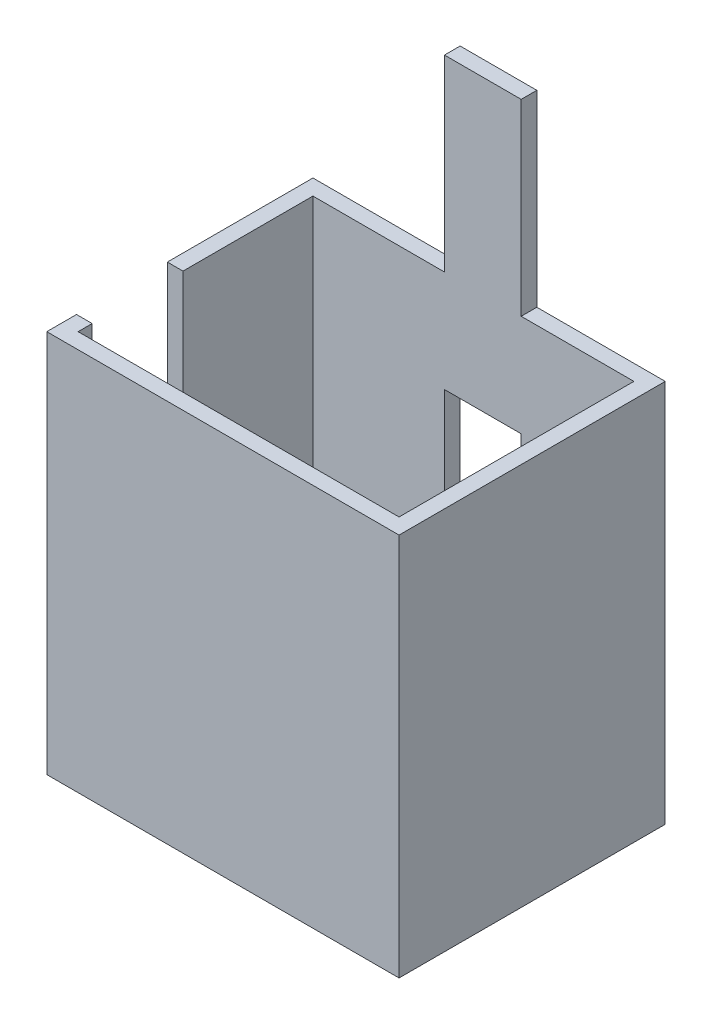
ISO-10303-21;
HEADER;
FILE_DESCRIPTION(('STEP AP214'),'2;1');
FILE_NAME('part.step','',(''),(''),'','','');
FILE_SCHEMA(('AUTOMOTIVE_DESIGN { 1 0 10303 214 1 1 1 1 }'));
ENDSEC;
DATA;
#1=APPLICATION_CONTEXT('core data for automotive mechanical design processes');
#2=APPLICATION_PROTOCOL_DEFINITION('international standard','automotive_design',2000,#1);
#3=PRODUCT_CONTEXT('',#1,'mechanical');
#4=PRODUCT('Part','Part','',(#3));
#5=PRODUCT_RELATED_PRODUCT_CATEGORY('part','',(#4));
#6=PRODUCT_DEFINITION_FORMATION('','',#4);
#7=PRODUCT_DEFINITION_CONTEXT('part definition',#1,'design');
#8=PRODUCT_DEFINITION('design','',#6,#7);
#9=PRODUCT_DEFINITION_SHAPE('','',#8);
#10=(LENGTH_UNIT() NAMED_UNIT(*) SI_UNIT(.MILLI.,.METRE.));
#11=(NAMED_UNIT(*) PLANE_ANGLE_UNIT() SI_UNIT($,.RADIAN.));
#12=(NAMED_UNIT(*) SI_UNIT($,.STERADIAN.) SOLID_ANGLE_UNIT());
#13=UNCERTAINTY_MEASURE_WITH_UNIT(LENGTH_MEASURE(1.E-05),#10,'distance_accuracy_value','');
#14=(GEOMETRIC_REPRESENTATION_CONTEXT(3) GLOBAL_UNCERTAINTY_ASSIGNED_CONTEXT((#13)) GLOBAL_UNIT_ASSIGNED_CONTEXT((#10,
#11,#12)) REPRESENTATION_CONTEXT('',''));
#15=CARTESIAN_POINT('',(0.,0.,0.));
#16=DIRECTION('',(0.,0.,1.));
#17=DIRECTION('',(1.,0.,0.));
#18=AXIS2_PLACEMENT_3D('',#15,#16,#17);
#19=CARTESIAN_POINT('',(0.,0.,0.));
#20=DIRECTION('',(0.,1.,0.));
#21=DIRECTION('',(0.,0.,1.));
#22=AXIS2_PLACEMENT_3D('',#19,#20,#21);
#23=PLANE('',#22);
#24=DIRECTION('',(1.,0.,0.));
#25=VECTOR('',#24,1.);
#26=CARTESIAN_POINT('',(0.,0.,-1500.));
#27=LINE('',#26,#25);
#28=CARTESIAN_POINT('',(1330.,0.,-1500.));
#29=VERTEX_POINT('',#28);
#30=CARTESIAN_POINT('',(2050.,0.,-1500.));
#31=VERTEX_POINT('',#30);
#32=EDGE_CURVE('E333',#29,#31,#27,.T.);
#33=ORIENTED_EDGE('',*,*,#32,.F.);
#34=DIRECTION('',(0.,0.,1.));
#35=VECTOR('',#34,1.);
#36=CARTESIAN_POINT('',(1330.,0.,0.));
#37=LINE('',#36,#35);
#38=CARTESIAN_POINT('',(1330.,0.,-1600.));
#39=VERTEX_POINT('',#38);
#40=EDGE_CURVE('E204',#39,#29,#37,.T.);
#41=ORIENTED_EDGE('',*,*,#40,.F.);
#42=DIRECTION('',(1.,0.,0.));
#43=VECTOR('',#42,1.);
#44=CARTESIAN_POINT('',(0.,0.,-1600.));
#45=LINE('',#44,#43);
#46=CARTESIAN_POINT('',(2150.,0.,-1600.));
#47=VERTEX_POINT('',#46);
#48=EDGE_CURVE('E317',#39,#47,#45,.T.);
#49=ORIENTED_EDGE('',*,*,#48,.T.);
#50=DIRECTION('',(0.,0.,-1.));
#51=VECTOR('',#50,1.);
#52=CARTESIAN_POINT('',(2150.,0.,0.));
#53=LINE('',#52,#51);
#54=CARTESIAN_POINT('',(2150.,0.,100.));
#55=VERTEX_POINT('',#54);
#56=EDGE_CURVE('E313',#55,#47,#53,.T.);
#57=ORIENTED_EDGE('',*,*,#56,.F.);
#58=DIRECTION('',(1.,0.,0.));
#59=VECTOR('',#58,1.);
#60=CARTESIAN_POINT('',(0.,0.,100.));
#61=LINE('',#60,#59);
#62=CARTESIAN_POINT('',(-100.,0.,100.));
#63=VERTEX_POINT('',#62);
#64=EDGE_CURVE('E310',#63,#55,#61,.T.);
#65=ORIENTED_EDGE('',*,*,#64,.F.);
#66=DIRECTION('',(0.,0.,-1.));
#67=VECTOR('',#66,1.);
#68=CARTESIAN_POINT('',(-100.,0.,0.));
#69=LINE('',#68,#67);
#70=CARTESIAN_POINT('',(-100.,0.,-90.));
#71=VERTEX_POINT('',#70);
#72=EDGE_CURVE('E306',#63,#71,#69,.T.);
#73=ORIENTED_EDGE('',*,*,#72,.T.);
#74=DIRECTION('',(-1.,0.,0.));
#75=VECTOR('',#74,1.);
#76=CARTESIAN_POINT('',(0.,0.,-90.));
#77=LINE('',#76,#75);
#78=CARTESIAN_POINT('',(0.,0.,-90.));
#79=VERTEX_POINT('',#78);
#80=EDGE_CURVE('E302',#79,#71,#77,.T.);
#81=ORIENTED_EDGE('',*,*,#80,.F.);
#82=DIRECTION('',(0.,0.,-1.));
#83=VECTOR('',#82,1.);
#84=CARTESIAN_POINT('',(0.,0.,0.));
#85=LINE('',#84,#83);
#86=CARTESIAN_POINT('',(0.,0.,0.));
#87=VERTEX_POINT('',#86);
#88=EDGE_CURVE('E299',#87,#79,#85,.T.);
#89=ORIENTED_EDGE('',*,*,#88,.F.);
#90=DIRECTION('',(1.,0.,0.));
#91=VECTOR('',#90,1.);
#92=CARTESIAN_POINT('',(0.,0.,0.));
#93=LINE('',#92,#91);
#94=CARTESIAN_POINT('',(2050.,0.,0.));
#95=VERTEX_POINT('',#94);
#96=EDGE_CURVE('E295',#87,#95,#93,.T.);
#97=ORIENTED_EDGE('',*,*,#96,.T.);
#98=DIRECTION('',(0.,0.,-1.));
#99=VECTOR('',#98,1.);
#100=CARTESIAN_POINT('',(2050.,0.,0.));
#101=LINE('',#100,#99);
#102=EDGE_CURVE('E246',#95,#31,#101,.T.);
#103=ORIENTED_EDGE('',*,*,#102,.T.);
#104=EDGE_LOOP('',(#33,#41,#49,#57,#65,#73,#81,#89,#97,#103));
#105=FACE_BOUND('',#104,.T.);
#106=ADVANCED_FACE('F40',(#105),#23,.F.);
#107=CARTESIAN_POINT('',(0.,2450.,0.));
#108=DIRECTION('',(0.,1.,0.));
#109=DIRECTION('',(0.,0.,1.));
#110=AXIS2_PLACEMENT_3D('',#107,#108,#109);
#111=PLANE('',#110);
#112=DIRECTION('',(0.,0.,-1.));
#113=VECTOR('',#112,1.);
#114=CARTESIAN_POINT('',(1330.,2450.,0.));
#115=LINE('',#114,#113);
#116=CARTESIAN_POINT('',(1330.,2450.,-1500.));
#117=VERTEX_POINT('',#116);
#118=CARTESIAN_POINT('',(1330.,2450.,-1600.));
#119=VERTEX_POINT('',#118);
#120=EDGE_CURVE('E12',#117,#119,#115,.T.);
#121=ORIENTED_EDGE('',*,*,#120,.F.);
#122=DIRECTION('',(1.,0.,0.));
#123=VECTOR('',#122,1.);
#124=CARTESIAN_POINT('',(0.,2450.,-1500.));
#125=LINE('',#124,#123);
#126=CARTESIAN_POINT('',(2050.,2450.,-1500.));
#127=VERTEX_POINT('',#126);
#128=EDGE_CURVE('E288',#117,#127,#125,.T.);
#129=ORIENTED_EDGE('',*,*,#128,.T.);
#130=DIRECTION('',(0.,0.,-1.));
#131=VECTOR('',#130,1.);
#132=CARTESIAN_POINT('',(2050.,2450.,0.));
#133=LINE('',#132,#131);
#134=CARTESIAN_POINT('',(2050.,2450.,0.));
#135=VERTEX_POINT('',#134);
#136=EDGE_CURVE('E247',#135,#127,#133,.T.);
#137=ORIENTED_EDGE('',*,*,#136,.F.);
#138=DIRECTION('',(1.,0.,0.));
#139=VECTOR('',#138,1.);
#140=CARTESIAN_POINT('',(0.,2450.,0.));
#141=LINE('',#140,#139);
#142=CARTESIAN_POINT('',(0.,2450.,0.));
#143=VERTEX_POINT('',#142);
#144=EDGE_CURVE('E251',#143,#135,#141,.T.);
#145=ORIENTED_EDGE('',*,*,#144,.F.);
#146=DIRECTION('',(0.,0.,-1.));
#147=VECTOR('',#146,1.);
#148=CARTESIAN_POINT('',(0.,2450.,0.));
#149=LINE('',#148,#147);
#150=CARTESIAN_POINT('',(0.,2450.,-90.));
#151=VERTEX_POINT('',#150);
#152=EDGE_CURVE('E255',#143,#151,#149,.T.);
#153=ORIENTED_EDGE('',*,*,#152,.T.);
#154=DIRECTION('',(-1.,0.,0.));
#155=VECTOR('',#154,1.);
#156=CARTESIAN_POINT('',(0.,2450.,-90.));
#157=LINE('',#156,#155);
#158=CARTESIAN_POINT('',(-100.,2450.,-90.));
#159=VERTEX_POINT('',#158);
#160=EDGE_CURVE('E258',#151,#159,#157,.T.);
#161=ORIENTED_EDGE('',*,*,#160,.T.);
#162=DIRECTION('',(0.,0.,-1.));
#163=VECTOR('',#162,1.);
#164=CARTESIAN_POINT('',(-100.,2450.,0.));
#165=LINE('',#164,#163);
#166=CARTESIAN_POINT('',(-100.,2450.,100.));
#167=VERTEX_POINT('',#166);
#168=EDGE_CURVE('E261',#167,#159,#165,.T.);
#169=ORIENTED_EDGE('',*,*,#168,.F.);
#170=DIRECTION('',(1.,0.,0.));
#171=VECTOR('',#170,1.);
#172=CARTESIAN_POINT('',(0.,2450.,100.));
#173=LINE('',#172,#171);
#174=CARTESIAN_POINT('',(2150.,2450.,100.));
#175=VERTEX_POINT('',#174);
#176=EDGE_CURVE('E265',#167,#175,#173,.T.);
#177=ORIENTED_EDGE('',*,*,#176,.T.);
#178=DIRECTION('',(0.,0.,-1.));
#179=VECTOR('',#178,1.);
#180=CARTESIAN_POINT('',(2150.,2450.,0.));
#181=LINE('',#180,#179);
#182=CARTESIAN_POINT('',(2150.,2450.,-1600.));
#183=VERTEX_POINT('',#182);
#184=EDGE_CURVE('E268',#175,#183,#181,.T.);
#185=ORIENTED_EDGE('',*,*,#184,.T.);
#186=DIRECTION('',(1.,0.,0.));
#187=VECTOR('',#186,1.);
#188=CARTESIAN_POINT('',(0.,2450.,-1600.));
#189=LINE('',#188,#187);
#190=EDGE_CURVE('E272',#119,#183,#189,.T.);
#191=ORIENTED_EDGE('',*,*,#190,.F.);
#192=EDGE_LOOP('',(#121,#129,#137,#145,#153,#161,#169,#177,#185,#191));
#193=FACE_BOUND('',#192,.T.);
#194=ADVANCED_FACE('F428',(#193),#111,.T.);
#195=CARTESIAN_POINT('',(2050.,2450.,0.));
#196=DIRECTION('',(-1.,0.,0.));
#197=DIRECTION('',(0.,0.,1.));
#198=AXIS2_PLACEMENT_3D('',#195,#196,#197);
#199=PLANE('',#198);
#200=ORIENTED_EDGE('',*,*,#102,.F.);
#201=DIRECTION('',(0.,-1.,0.));
#202=VECTOR('',#201,1.);
#203=CARTESIAN_POINT('',(2050.,2450.,0.));
#204=LINE('',#203,#202);
#205=EDGE_CURVE('E372',#135,#95,#204,.T.);
#206=ORIENTED_EDGE('',*,*,#205,.F.);
#207=ORIENTED_EDGE('',*,*,#136,.T.);
#208=DIRECTION('',(0.,-1.,0.));
#209=VECTOR('',#208,1.);
#210=CARTESIAN_POINT('',(2050.,2450.,-1500.));
#211=LINE('',#210,#209);
#212=EDGE_CURVE('E291',#127,#31,#211,.T.);
#213=ORIENTED_EDGE('',*,*,#212,.T.);
#214=EDGE_LOOP('',(#200,#206,#207,#213));
#215=FACE_BOUND('',#214,.T.);
#216=ADVANCED_FACE('F42',(#215),#199,.T.);
#217=CARTESIAN_POINT('',(0.,2450.,0.));
#218=DIRECTION('',(0.,0.,-1.));
#219=DIRECTION('',(-1.,0.,0.));
#220=AXIS2_PLACEMENT_3D('',#217,#218,#219);
#221=PLANE('',#220);
#222=ORIENTED_EDGE('',*,*,#96,.F.);
#223=DIRECTION('',(0.,-1.,0.));
#224=VECTOR('',#223,1.);
#225=CARTESIAN_POINT('',(0.,2450.,0.));
#226=LINE('',#225,#224);
#227=EDGE_CURVE('E369',#143,#87,#226,.T.);
#228=ORIENTED_EDGE('',*,*,#227,.F.);
#229=ORIENTED_EDGE('',*,*,#144,.T.);
#230=ORIENTED_EDGE('',*,*,#205,.T.);
#231=EDGE_LOOP('',(#222,#228,#229,#230));
#232=FACE_BOUND('',#231,.T.);
#233=ADVANCED_FACE('F434',(#232),#221,.T.);
#234=CARTESIAN_POINT('',(0.,2450.,0.));
#235=DIRECTION('',(-1.,0.,0.));
#236=DIRECTION('',(0.,0.,1.));
#237=AXIS2_PLACEMENT_3D('',#234,#235,#236);
#238=PLANE('',#237);
#239=ORIENTED_EDGE('',*,*,#88,.T.);
#240=DIRECTION('',(0.,-1.,0.));
#241=VECTOR('',#240,1.);
#242=CARTESIAN_POINT('',(0.,2450.,-90.));
#243=LINE('',#242,#241);
#244=EDGE_CURVE('E365',#151,#79,#243,.T.);
#245=ORIENTED_EDGE('',*,*,#244,.F.);
#246=ORIENTED_EDGE('',*,*,#152,.F.);
#247=ORIENTED_EDGE('',*,*,#227,.T.);
#248=EDGE_LOOP('',(#239,#245,#246,#247));
#249=FACE_BOUND('',#248,.T.);
#250=ADVANCED_FACE('F441',(#249),#238,.F.);
#251=CARTESIAN_POINT('',(0.,2450.,-90.));
#252=DIRECTION('',(0.,0.,1.));
#253=DIRECTION('',(1.,0.,0.));
#254=AXIS2_PLACEMENT_3D('',#251,#252,#253);
#255=PLANE('',#254);
#256=ORIENTED_EDGE('',*,*,#80,.T.);
#257=DIRECTION('',(0.,-1.,0.));
#258=VECTOR('',#257,1.);
#259=CARTESIAN_POINT('',(-100.,2450.,-90.));
#260=LINE('',#259,#258);
#261=EDGE_CURVE('E362',#159,#71,#260,.T.);
#262=ORIENTED_EDGE('',*,*,#261,.F.);
#263=ORIENTED_EDGE('',*,*,#160,.F.);
#264=ORIENTED_EDGE('',*,*,#244,.T.);
#265=EDGE_LOOP('',(#256,#262,#263,#264));
#266=FACE_BOUND('',#265,.T.);
#267=ADVANCED_FACE('F445',(#266),#255,.F.);
#268=CARTESIAN_POINT('',(-100.,2450.,0.));
#269=DIRECTION('',(-1.,0.,0.));
#270=DIRECTION('',(0.,0.,1.));
#271=AXIS2_PLACEMENT_3D('',#268,#269,#270);
#272=PLANE('',#271);
#273=ORIENTED_EDGE('',*,*,#72,.F.);
#274=DIRECTION('',(0.,-1.,0.));
#275=VECTOR('',#274,1.);
#276=CARTESIAN_POINT('',(-100.,2450.,100.));
#277=LINE('',#276,#275);
#278=EDGE_CURVE('E359',#167,#63,#277,.T.);
#279=ORIENTED_EDGE('',*,*,#278,.F.);
#280=ORIENTED_EDGE('',*,*,#168,.T.);
#281=ORIENTED_EDGE('',*,*,#261,.T.);
#282=EDGE_LOOP('',(#273,#279,#280,#281));
#283=FACE_BOUND('',#282,.T.);
#284=ADVANCED_FACE('F448',(#283),#272,.T.);
#285=CARTESIAN_POINT('',(0.,2450.,100.));
#286=DIRECTION('',(0.,0.,-1.));
#287=DIRECTION('',(-1.,0.,0.));
#288=AXIS2_PLACEMENT_3D('',#285,#286,#287);
#289=PLANE('',#288);
#290=ORIENTED_EDGE('',*,*,#64,.T.);
#291=DIRECTION('',(0.,-1.,0.));
#292=VECTOR('',#291,1.);
#293=CARTESIAN_POINT('',(2150.,2450.,100.));
#294=LINE('',#293,#292);
#295=EDGE_CURVE('E355',#175,#55,#294,.T.);
#296=ORIENTED_EDGE('',*,*,#295,.F.);
#297=ORIENTED_EDGE('',*,*,#176,.F.);
#298=ORIENTED_EDGE('',*,*,#278,.T.);
#299=EDGE_LOOP('',(#290,#296,#297,#298));
#300=FACE_BOUND('',#299,.T.);
#301=ADVANCED_FACE('F453',(#300),#289,.F.);
#302=CARTESIAN_POINT('',(2150.,2450.,0.));
#303=DIRECTION('',(-1.,0.,0.));
#304=DIRECTION('',(0.,0.,1.));
#305=AXIS2_PLACEMENT_3D('',#302,#303,#304);
#306=PLANE('',#305);
#307=ORIENTED_EDGE('',*,*,#56,.T.);
#308=DIRECTION('',(0.,-1.,0.));
#309=VECTOR('',#308,1.);
#310=CARTESIAN_POINT('',(2150.,2450.,-1600.));
#311=LINE('',#310,#309);
#312=EDGE_CURVE('E351',#183,#47,#311,.T.);
#313=ORIENTED_EDGE('',*,*,#312,.F.);
#314=ORIENTED_EDGE('',*,*,#184,.F.);
#315=ORIENTED_EDGE('',*,*,#295,.T.);
#316=EDGE_LOOP('',(#307,#313,#314,#315));
#317=FACE_BOUND('',#316,.T.);
#318=ADVANCED_FACE('F456',(#317),#306,.F.);
#319=CARTESIAN_POINT('',(0.,2450.,-1600.));
#320=DIRECTION('',(0.,0.,-1.));
#321=DIRECTION('',(-1.,0.,0.));
#322=AXIS2_PLACEMENT_3D('',#319,#320,#321);
#323=PLANE('',#322);
#324=DIRECTION('',(0.,-1.,0.));
#325=VECTOR('',#324,1.);
#326=CARTESIAN_POINT('',(1330.,2950.099990002,-1600.));
#327=LINE('',#326,#325);
#328=CARTESIAN_POINT('',(1330.,1800.,-1600.));
#329=VERTEX_POINT('',#328);
#330=EDGE_CURVE('E196',#329,#39,#327,.T.);
#331=ORIENTED_EDGE('',*,*,#330,.F.);
#332=DIRECTION('',(1.,0.,0.));
#333=VECTOR('',#332,1.);
#334=CARTESIAN_POINT('',(0.,1800.,-1600.));
#335=LINE('',#334,#333);
#336=CARTESIAN_POINT('',(840.,1800.,-1600.));
#337=VERTEX_POINT('',#336);
#338=EDGE_CURVE('E215',#337,#329,#335,.T.);
#339=ORIENTED_EDGE('',*,*,#338,.F.);
#340=DIRECTION('',(0.,-1.,0.));
#341=VECTOR('',#340,1.);
#342=CARTESIAN_POINT('',(840.,2950.099990002,-1600.));
#343=LINE('',#342,#341);
#344=CARTESIAN_POINT('',(840.,0.,-1600.));
#345=VERTEX_POINT('',#344);
#346=EDGE_CURVE('E193',#337,#345,#343,.T.);
#347=ORIENTED_EDGE('',*,*,#346,.T.);
#348=CARTESIAN_POINT('',(-100.,0.,-1600.));
#349=VERTEX_POINT('',#348);
#350=EDGE_CURVE('E318',#349,#345,#45,.T.);
#351=ORIENTED_EDGE('',*,*,#350,.F.);
#352=DIRECTION('',(0.,-1.,0.));
#353=VECTOR('',#352,1.);
#354=CARTESIAN_POINT('',(-100.,2450.,-1600.));
#355=LINE('',#354,#353);
#356=CARTESIAN_POINT('',(-100.,2450.,-1600.));
#357=VERTEX_POINT('',#356);
#358=EDGE_CURVE('E348',#357,#349,#355,.T.);
#359=ORIENTED_EDGE('',*,*,#358,.F.);
#360=CARTESIAN_POINT('',(840.,2450.,-1600.));
#361=VERTEX_POINT('',#360);
#362=EDGE_CURVE('E273',#357,#361,#189,.T.);
#363=ORIENTED_EDGE('',*,*,#362,.T.);
#364=DIRECTION('',(0.,-1.,0.));
#365=VECTOR('',#364,1.);
#366=CARTESIAN_POINT('',(840.,3650.,-1600.));
#367=LINE('',#366,#365);
#368=CARTESIAN_POINT('',(840.,3650.,-1600.));
#369=VERTEX_POINT('',#368);
#370=EDGE_CURVE('E238',#369,#361,#367,.T.);
#371=ORIENTED_EDGE('',*,*,#370,.F.);
#372=DIRECTION('',(1.,0.,0.));
#373=VECTOR('',#372,1.);
#374=CARTESIAN_POINT('',(0.,3650.,-1600.));
#375=LINE('',#374,#373);
#376=CARTESIAN_POINT('',(1330.,3650.,-1600.));
#377=VERTEX_POINT('',#376);
#378=EDGE_CURVE('E219',#369,#377,#375,.T.);
#379=ORIENTED_EDGE('',*,*,#378,.T.);
#380=DIRECTION('',(0.,-1.,0.));
#381=VECTOR('',#380,1.);
#382=CARTESIAN_POINT('',(1330.,3650.,-1600.));
#383=LINE('',#382,#381);
#384=EDGE_CURVE('E242',#377,#119,#383,.T.);
#385=ORIENTED_EDGE('',*,*,#384,.T.);
#386=ORIENTED_EDGE('',*,*,#190,.T.);
#387=ORIENTED_EDGE('',*,*,#312,.T.);
#388=ORIENTED_EDGE('',*,*,#48,.F.);
#389=EDGE_LOOP('',(#331,#339,#347,#351,#359,#363,#371,#379,#385,#386,#387,#388));
#390=FACE_BOUND('',#389,.T.);
#391=ADVANCED_FACE('F387',(#390),#323,.T.);
#392=CARTESIAN_POINT('',(-100.,2450.,0.));
#393=DIRECTION('',(-1.,0.,0.));
#394=DIRECTION('',(0.,0.,1.));
#395=AXIS2_PLACEMENT_3D('',#392,#393,#394);
#396=PLANE('',#395);
#397=DIRECTION('',(0.,0.,-1.));
#398=VECTOR('',#397,1.);
#399=CARTESIAN_POINT('',(-100.,0.,0.));
#400=LINE('',#399,#398);
#401=CARTESIAN_POINT('',(-100.,0.,-670.));
#402=VERTEX_POINT('',#401);
#403=EDGE_CURVE('E322',#402,#349,#400,.T.);
#404=ORIENTED_EDGE('',*,*,#403,.F.);
#405=DIRECTION('',(0.,-1.,0.));
#406=VECTOR('',#405,1.);
#407=CARTESIAN_POINT('',(-100.,2450.,-670.));
#408=LINE('',#407,#406);
#409=CARTESIAN_POINT('',(-100.,2450.,-670.));
#410=VERTEX_POINT('',#409);
#411=EDGE_CURVE('E345',#410,#402,#408,.T.);
#412=ORIENTED_EDGE('',*,*,#411,.F.);
#413=DIRECTION('',(0.,0.,-1.));
#414=VECTOR('',#413,1.);
#415=CARTESIAN_POINT('',(-100.,2450.,0.));
#416=LINE('',#415,#414);
#417=EDGE_CURVE('E277',#410,#357,#416,.T.);
#418=ORIENTED_EDGE('',*,*,#417,.T.);
#419=ORIENTED_EDGE('',*,*,#358,.T.);
#420=EDGE_LOOP('',(#404,#412,#418,#419));
#421=FACE_BOUND('',#420,.T.);
#422=ADVANCED_FACE('F394',(#421),#396,.T.);
#423=CARTESIAN_POINT('',(0.,2450.,-670.));
#424=DIRECTION('',(0.,0.,1.));
#425=DIRECTION('',(1.,0.,0.));
#426=AXIS2_PLACEMENT_3D('',#423,#424,#425);
#427=PLANE('',#426);
#428=DIRECTION('',(-1.,0.,0.));
#429=VECTOR('',#428,1.);
#430=CARTESIAN_POINT('',(0.,0.,-670.));
#431=LINE('',#430,#429);
#432=CARTESIAN_POINT('',(0.,0.,-670.));
#433=VERTEX_POINT('',#432);
#434=EDGE_CURVE('E326',#433,#402,#431,.T.);
#435=ORIENTED_EDGE('',*,*,#434,.F.);
#436=DIRECTION('',(0.,-1.,0.));
#437=VECTOR('',#436,1.);
#438=CARTESIAN_POINT('',(0.,2450.,-670.));
#439=LINE('',#438,#437);
#440=CARTESIAN_POINT('',(0.,2450.,-670.));
#441=VERTEX_POINT('',#440);
#442=EDGE_CURVE('E342',#441,#433,#439,.T.);
#443=ORIENTED_EDGE('',*,*,#442,.F.);
#444=DIRECTION('',(-1.,0.,0.));
#445=VECTOR('',#444,1.);
#446=CARTESIAN_POINT('',(0.,2450.,-670.));
#447=LINE('',#446,#445);
#448=EDGE_CURVE('E281',#441,#410,#447,.T.);
#449=ORIENTED_EDGE('',*,*,#448,.T.);
#450=ORIENTED_EDGE('',*,*,#411,.T.);
#451=EDGE_LOOP('',(#435,#443,#449,#450));
#452=FACE_BOUND('',#451,.T.);
#453=ADVANCED_FACE('F397',(#452),#427,.T.);
#454=CARTESIAN_POINT('',(0.,2450.,0.));
#455=DIRECTION('',(-1.,0.,0.));
#456=DIRECTION('',(0.,0.,1.));
#457=AXIS2_PLACEMENT_3D('',#454,#455,#456);
#458=PLANE('',#457);
#459=DIRECTION('',(0.,0.,-1.));
#460=VECTOR('',#459,1.);
#461=CARTESIAN_POINT('',(0.,0.,0.));
#462=LINE('',#461,#460);
#463=CARTESIAN_POINT('',(0.,0.,-1500.));
#464=VERTEX_POINT('',#463);
#465=EDGE_CURVE('E330',#433,#464,#462,.T.);
#466=ORIENTED_EDGE('',*,*,#465,.T.);
#467=DIRECTION('',(0.,-1.,0.));
#468=VECTOR('',#467,1.);
#469=CARTESIAN_POINT('',(0.,2450.,-1500.));
#470=LINE('',#469,#468);
#471=CARTESIAN_POINT('',(0.,2450.,-1500.));
#472=VERTEX_POINT('',#471);
#473=EDGE_CURVE('E339',#472,#464,#470,.T.);
#474=ORIENTED_EDGE('',*,*,#473,.F.);
#475=DIRECTION('',(0.,0.,-1.));
#476=VECTOR('',#475,1.);
#477=CARTESIAN_POINT('',(0.,2450.,0.));
#478=LINE('',#477,#476);
#479=EDGE_CURVE('E285',#441,#472,#478,.T.);
#480=ORIENTED_EDGE('',*,*,#479,.F.);
#481=ORIENTED_EDGE('',*,*,#442,.T.);
#482=EDGE_LOOP('',(#466,#474,#480,#481));
#483=FACE_BOUND('',#482,.T.);
#484=ADVANCED_FACE('F401',(#483),#458,.F.);
#485=CARTESIAN_POINT('',(0.,2450.,-1500.));
#486=DIRECTION('',(0.,0.,-1.));
#487=DIRECTION('',(-1.,0.,0.));
#488=AXIS2_PLACEMENT_3D('',#485,#486,#487);
#489=PLANE('',#488);
#490=DIRECTION('',(1.,0.,0.));
#491=VECTOR('',#490,1.);
#492=CARTESIAN_POINT('',(0.,1800.,-1500.));
#493=LINE('',#492,#491);
#494=CARTESIAN_POINT('',(840.,1800.,-1500.));
#495=VERTEX_POINT('',#494);
#496=CARTESIAN_POINT('',(1330.,1800.,-1500.));
#497=VERTEX_POINT('',#496);
#498=EDGE_CURVE('E179',#495,#497,#493,.T.);
#499=ORIENTED_EDGE('',*,*,#498,.T.);
#500=DIRECTION('',(0.,-1.,0.));
#501=VECTOR('',#500,1.);
#502=CARTESIAN_POINT('',(1330.,2950.099990002,-1500.));
#503=LINE('',#502,#501);
#504=EDGE_CURVE('E212',#497,#29,#503,.T.);
#505=ORIENTED_EDGE('',*,*,#504,.T.);
#506=ORIENTED_EDGE('',*,*,#32,.T.);
#507=ORIENTED_EDGE('',*,*,#212,.F.);
#508=ORIENTED_EDGE('',*,*,#128,.F.);
#509=DIRECTION('',(0.,-1.,0.));
#510=VECTOR('',#509,1.);
#511=CARTESIAN_POINT('',(1330.,3650.,-1500.));
#512=LINE('',#511,#510);
#513=CARTESIAN_POINT('',(1330.,3650.,-1500.));
#514=VERTEX_POINT('',#513);
#515=EDGE_CURVE('E230',#514,#117,#512,.T.);
#516=ORIENTED_EDGE('',*,*,#515,.F.);
#517=DIRECTION('',(1.,0.,0.));
#518=VECTOR('',#517,1.);
#519=CARTESIAN_POINT('',(0.,3650.,-1500.));
#520=LINE('',#519,#518);
#521=CARTESIAN_POINT('',(840.,3650.,-1500.));
#522=VERTEX_POINT('',#521);
#523=EDGE_CURVE('E227',#522,#514,#520,.T.);
#524=ORIENTED_EDGE('',*,*,#523,.F.);
#525=DIRECTION('',(0.,-1.,0.));
#526=VECTOR('',#525,1.);
#527=CARTESIAN_POINT('',(840.,3650.,-1500.));
#528=LINE('',#527,#526);
#529=CARTESIAN_POINT('',(840.,2450.,-1500.));
#530=VERTEX_POINT('',#529);
#531=EDGE_CURVE('E234',#522,#530,#528,.T.);
#532=ORIENTED_EDGE('',*,*,#531,.T.);
#533=EDGE_CURVE('E64',#472,#530,#125,.T.);
#534=ORIENTED_EDGE('',*,*,#533,.F.);
#535=ORIENTED_EDGE('',*,*,#473,.T.);
#536=CARTESIAN_POINT('',(840.,0.,-1500.));
#537=VERTEX_POINT('',#536);
#538=EDGE_CURVE('E202',#464,#537,#27,.T.);
#539=ORIENTED_EDGE('',*,*,#538,.T.);
#540=DIRECTION('',(0.,-1.,0.));
#541=VECTOR('',#540,1.);
#542=CARTESIAN_POINT('',(840.,2950.099990002,-1500.));
#543=LINE('',#542,#541);
#544=EDGE_CURVE('E56',#495,#537,#543,.T.);
#545=ORIENTED_EDGE('',*,*,#544,.F.);
#546=EDGE_LOOP('',(#499,#505,#506,#507,#508,#516,#524,#532,#534,#535,#539,#545));
#547=FACE_BOUND('',#546,.T.);
#548=ADVANCED_FACE('F199',(#547),#489,.F.);
#549=DIRECTION('',(0.,0.,1.));
#550=VECTOR('',#549,1.);
#551=CARTESIAN_POINT('',(840.,2450.,0.));
#552=LINE('',#551,#550);
#553=EDGE_CURVE('E49',#361,#530,#552,.T.);
#554=ORIENTED_EDGE('',*,*,#553,.F.);
#555=ORIENTED_EDGE('',*,*,#362,.F.);
#556=ORIENTED_EDGE('',*,*,#417,.F.);
#557=ORIENTED_EDGE('',*,*,#448,.F.);
#558=ORIENTED_EDGE('',*,*,#479,.T.);
#559=ORIENTED_EDGE('',*,*,#533,.T.);
#560=EDGE_LOOP('',(#554,#555,#556,#557,#558,#559));
#561=FACE_BOUND('',#560,.T.);
#562=ADVANCED_FACE('F390',(#561),#111,.T.);
#563=ORIENTED_EDGE('',*,*,#350,.T.);
#564=DIRECTION('',(0.,0.,-1.));
#565=VECTOR('',#564,1.);
#566=CARTESIAN_POINT('',(840.,0.,0.));
#567=LINE('',#566,#565);
#568=EDGE_CURVE('E189',#537,#345,#567,.T.);
#569=ORIENTED_EDGE('',*,*,#568,.F.);
#570=ORIENTED_EDGE('',*,*,#538,.F.);
#571=ORIENTED_EDGE('',*,*,#465,.F.);
#572=ORIENTED_EDGE('',*,*,#434,.T.);
#573=ORIENTED_EDGE('',*,*,#403,.T.);
#574=EDGE_LOOP('',(#563,#569,#570,#571,#572,#573));
#575=FACE_BOUND('',#574,.T.);
#576=ADVANCED_FACE('F404',(#575),#23,.F.);
#577=CARTESIAN_POINT('',(1330.,3650.,0.));
#578=DIRECTION('',(1.,0.,0.));
#579=DIRECTION('',(0.,0.,-1.));
#580=AXIS2_PLACEMENT_3D('',#577,#578,#579);
#581=PLANE('',#580);
#582=ORIENTED_EDGE('',*,*,#515,.T.);
#583=ORIENTED_EDGE('',*,*,#120,.T.);
#584=ORIENTED_EDGE('',*,*,#384,.F.);
#585=DIRECTION('',(0.,0.,1.));
#586=VECTOR('',#585,1.);
#587=CARTESIAN_POINT('',(1330.,3650.,0.));
#588=LINE('',#587,#586);
#589=EDGE_CURVE('E188',#377,#514,#588,.T.);
#590=ORIENTED_EDGE('',*,*,#589,.T.);
#591=EDGE_LOOP('',(#582,#583,#584,#590));
#592=FACE_BOUND('',#591,.T.);
#593=ADVANCED_FACE('F473',(#592),#581,.T.);
#594=CARTESIAN_POINT('',(840.,3650.,0.));
#595=DIRECTION('',(-1.,0.,0.));
#596=DIRECTION('',(0.,0.,1.));
#597=AXIS2_PLACEMENT_3D('',#594,#595,#596);
#598=PLANE('',#597);
#599=ORIENTED_EDGE('',*,*,#370,.T.);
#600=ORIENTED_EDGE('',*,*,#553,.T.);
#601=ORIENTED_EDGE('',*,*,#531,.F.);
#602=DIRECTION('',(0.,0.,-1.));
#603=VECTOR('',#602,1.);
#604=CARTESIAN_POINT('',(840.,3650.,0.));
#605=LINE('',#604,#603);
#606=EDGE_CURVE('E223',#522,#369,#605,.T.);
#607=ORIENTED_EDGE('',*,*,#606,.T.);
#608=EDGE_LOOP('',(#599,#600,#601,#607));
#609=FACE_BOUND('',#608,.T.);
#610=ADVANCED_FACE('F376',(#609),#598,.T.);
#611=CARTESIAN_POINT('',(0.,3650.,0.));
#612=DIRECTION('',(0.,1.,0.));
#613=DIRECTION('',(0.,0.,1.));
#614=AXIS2_PLACEMENT_3D('',#611,#612,#613);
#615=PLANE('',#614);
#616=ORIENTED_EDGE('',*,*,#589,.F.);
#617=ORIENTED_EDGE('',*,*,#378,.F.);
#618=ORIENTED_EDGE('',*,*,#606,.F.);
#619=ORIENTED_EDGE('',*,*,#523,.T.);
#620=EDGE_LOOP('',(#616,#617,#618,#619));
#621=FACE_BOUND('',#620,.T.);
#622=ADVANCED_FACE('F384',(#621),#615,.T.);
#623=CARTESIAN_POINT('',(1330.,2950.099990002,0.));
#624=DIRECTION('',(1.,0.,0.));
#625=DIRECTION('',(0.,0.,-1.));
#626=AXIS2_PLACEMENT_3D('',#623,#624,#625);
#627=PLANE('',#626);
#628=ORIENTED_EDGE('',*,*,#330,.T.);
#629=ORIENTED_EDGE('',*,*,#40,.T.);
#630=ORIENTED_EDGE('',*,*,#504,.F.);
#631=DIRECTION('',(0.,0.,1.));
#632=VECTOR('',#631,1.);
#633=CARTESIAN_POINT('',(1330.,1800.,0.));
#634=LINE('',#633,#632);
#635=EDGE_CURVE('E184',#329,#497,#634,.T.);
#636=ORIENTED_EDGE('',*,*,#635,.F.);
#637=EDGE_LOOP('',(#628,#629,#630,#636));
#638=FACE_BOUND('',#637,.T.);
#639=ADVANCED_FACE('F414',(#638),#627,.F.);
#640=CARTESIAN_POINT('',(840.,2950.099990002,0.));
#641=DIRECTION('',(-1.,0.,0.));
#642=DIRECTION('',(0.,0.,1.));
#643=AXIS2_PLACEMENT_3D('',#640,#641,#642);
#644=PLANE('',#643);
#645=ORIENTED_EDGE('',*,*,#544,.T.);
#646=ORIENTED_EDGE('',*,*,#568,.T.);
#647=ORIENTED_EDGE('',*,*,#346,.F.);
#648=DIRECTION('',(0.,0.,-1.));
#649=VECTOR('',#648,1.);
#650=CARTESIAN_POINT('',(840.,1800.,0.));
#651=LINE('',#650,#649);
#652=EDGE_CURVE('E181',#495,#337,#651,.T.);
#653=ORIENTED_EDGE('',*,*,#652,.F.);
#654=EDGE_LOOP('',(#645,#646,#647,#653));
#655=FACE_BOUND('',#654,.T.);
#656=ADVANCED_FACE('F191',(#655),#644,.F.);
#657=CARTESIAN_POINT('',(0.,1800.,0.));
#658=DIRECTION('',(0.,1.,0.));
#659=DIRECTION('',(0.,0.,1.));
#660=AXIS2_PLACEMENT_3D('',#657,#658,#659);
#661=PLANE('',#660);
#662=ORIENTED_EDGE('',*,*,#635,.T.);
#663=ORIENTED_EDGE('',*,*,#498,.F.);
#664=ORIENTED_EDGE('',*,*,#652,.T.);
#665=ORIENTED_EDGE('',*,*,#338,.T.);
#666=EDGE_LOOP('',(#662,#663,#664,#665));
#667=FACE_BOUND('',#666,.T.);
#668=ADVANCED_FACE('F180',(#667),#661,.F.);
#669=CLOSED_SHELL('',(#106,#194,#216,#233,#250,#267,#284,#301,#318,#391,#422,#453,#484,#548,
#562,#576,#593,#610,#622,#639,#656,#668));
#670=MANIFOLD_SOLID_BREP('B2',#669);
#671=ADVANCED_BREP_SHAPE_REPRESENTATION('',(#18,#670),#14);
#672=SHAPE_DEFINITION_REPRESENTATION(#9,#671);
ENDSEC;
END-ISO-10303-21;
